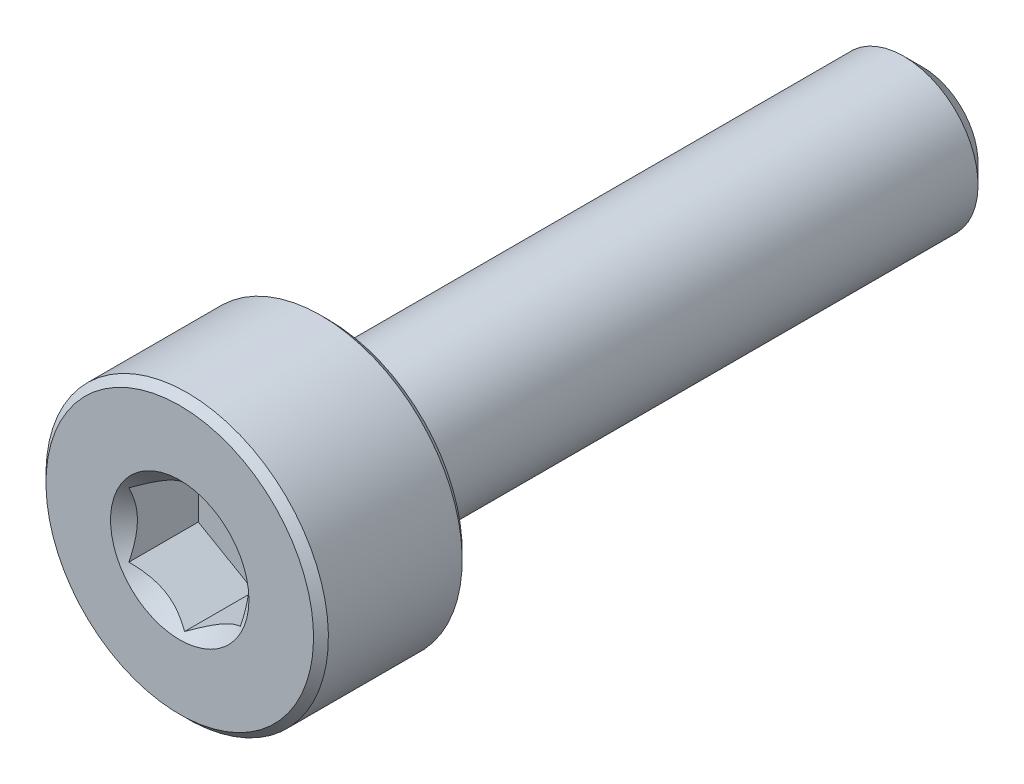
ISO-10303-21;
HEADER;
FILE_DESCRIPTION(('STEP AP214'),'2;1');
FILE_NAME('part.step','',(''),(''),'','','');
FILE_SCHEMA(('AUTOMOTIVE_DESIGN { 1 0 10303 214 1 1 1 1 }'));
ENDSEC;
DATA;
#1=APPLICATION_CONTEXT('core data for automotive mechanical design processes');
#2=APPLICATION_PROTOCOL_DEFINITION('international standard','automotive_design',2000,#1);
#3=PRODUCT_CONTEXT('',#1,'mechanical');
#4=PRODUCT('Part','Part','',(#3));
#5=PRODUCT_RELATED_PRODUCT_CATEGORY('part','',(#4));
#6=PRODUCT_DEFINITION_FORMATION('','',#4);
#7=PRODUCT_DEFINITION_CONTEXT('part definition',#1,'design');
#8=PRODUCT_DEFINITION('design','',#6,#7);
#9=PRODUCT_DEFINITION_SHAPE('','',#8);
#10=(LENGTH_UNIT() NAMED_UNIT(*) SI_UNIT(.MILLI.,.METRE.));
#11=(NAMED_UNIT(*) PLANE_ANGLE_UNIT() SI_UNIT($,.RADIAN.));
#12=(NAMED_UNIT(*) SI_UNIT($,.STERADIAN.) SOLID_ANGLE_UNIT());
#13=UNCERTAINTY_MEASURE_WITH_UNIT(LENGTH_MEASURE(1.E-05),#10,'distance_accuracy_value','');
#14=(GEOMETRIC_REPRESENTATION_CONTEXT(3) GLOBAL_UNCERTAINTY_ASSIGNED_CONTEXT((#13)) GLOBAL_UNIT_ASSIGNED_CONTEXT((#10,
#11,#12)) REPRESENTATION_CONTEXT('',''));
#15=CARTESIAN_POINT('',(0.,0.,0.));
#16=DIRECTION('',(0.,0.,1.));
#17=DIRECTION('',(1.,0.,0.));
#18=AXIS2_PLACEMENT_3D('',#15,#16,#17);
#19=CARTESIAN_POINT('',(0.,0.740192378864668,-5.));
#20=DIRECTION('',(0.,0.,-1.));
#21=DIRECTION('',(0.,1.,0.));
#22=AXIS2_PLACEMENT_3D('',#19,#20,#21);
#23=PLANE('',#22);
#24=CARTESIAN_POINT('',(0.,0.,-5.));
#25=DIRECTION('',(0.,0.,-1.));
#26=DIRECTION('',(0.,1.,0.));
#27=AXIS2_PLACEMENT_3D('',#24,#25,#26);
#28=CIRCLE('',#27,0.740192378864668);
#29=CARTESIAN_POINT('',(0.,0.740192378864668,-5.));
#30=VERTEX_POINT('',#29);
#31=EDGE_CURVE('E57',#30,#30,#28,.T.);
#32=ORIENTED_EDGE('',*,*,#31,.T.);
#33=EDGE_LOOP('',(#32));
#34=FACE_BOUND('',#33,.T.);
#35=ADVANCED_FACE('F43',(#34),#23,.T.);
#36=CARTESIAN_POINT('',(0.,0.,-5.));
#37=DIRECTION('',(0.,0.,1.));
#38=DIRECTION('',(0.,-1.,0.));
#39=AXIS2_PLACEMENT_3D('',#36,#37,#38);
#40=CONICAL_SURFACE('',#39,0.740192378864668,0.785398163397447);
#41=CARTESIAN_POINT('',(0.,0.,-4.74019237886467));
#42=DIRECTION('',(0.,0.,-1.));
#43=DIRECTION('',(0.,1.,0.));
#44=AXIS2_PLACEMENT_3D('',#41,#42,#43);
#45=CIRCLE('',#44,1.);
#46=CARTESIAN_POINT('',(0.,1.,-4.74019237886467));
#47=VERTEX_POINT('',#46);
#48=EDGE_CURVE('E175',#47,#47,#45,.T.);
#49=ORIENTED_EDGE('',*,*,#48,.T.);
#50=EDGE_LOOP('',(#49));
#51=FACE_BOUND('',#50,.T.);
#52=ORIENTED_EDGE('',*,*,#31,.F.);
#53=EDGE_LOOP('',(#52));
#54=FACE_BOUND('',#53,.T.);
#55=ADVANCED_FACE('F183',(#51,#54),#40,.T.);
#56=CARTESIAN_POINT('',(0.,0.,-5.));
#57=DIRECTION('',(0.,0.,-1.));
#58=DIRECTION('',(0.,1.,0.));
#59=AXIS2_PLACEMENT_3D('',#56,#57,#58);
#60=CYLINDRICAL_SURFACE('',#59,1.);
#61=CARTESIAN_POINT('',(0.,0.,2.9));
#62=DIRECTION('',(0.,0.,-1.));
#63=DIRECTION('',(0.,1.,0.));
#64=AXIS2_PLACEMENT_3D('',#61,#62,#63);
#65=CIRCLE('',#64,1.);
#66=CARTESIAN_POINT('',(0.,1.,2.9));
#67=VERTEX_POINT('',#66);
#68=EDGE_CURVE('E171',#67,#67,#65,.T.);
#69=ORIENTED_EDGE('',*,*,#68,.T.);
#70=EDGE_LOOP('',(#69));
#71=FACE_BOUND('',#70,.T.);
#72=ORIENTED_EDGE('',*,*,#48,.F.);
#73=EDGE_LOOP('',(#72));
#74=FACE_BOUND('',#73,.T.);
#75=ADVANCED_FACE('F185',(#71,#74),#60,.T.);
#76=CARTESIAN_POINT('',(0.,0.,2.9));
#77=DIRECTION('',(0.,0.,-1.));
#78=DIRECTION('',(0.,1.,0.));
#79=AXIS2_PLACEMENT_3D('',#76,#77,#78);
#80=TOROIDAL_SURFACE('',#79,1.1,0.0999999999999992);
#81=CARTESIAN_POINT('',(0.,0.,3.));
#82=DIRECTION('',(0.,0.,-1.));
#83=DIRECTION('',(0.,1.,0.));
#84=AXIS2_PLACEMENT_3D('',#81,#82,#83);
#85=CIRCLE('',#84,1.1);
#86=CARTESIAN_POINT('',(0.,1.1,3.));
#87=VERTEX_POINT('',#86);
#88=EDGE_CURVE('E167',#87,#87,#85,.T.);
#89=ORIENTED_EDGE('',*,*,#88,.T.);
#90=EDGE_LOOP('',(#89));
#91=FACE_BOUND('',#90,.T.);
#92=ORIENTED_EDGE('',*,*,#68,.F.);
#93=EDGE_LOOP('',(#92));
#94=FACE_BOUND('',#93,.T.);
#95=ADVANCED_FACE('F191',(#91,#94),#80,.F.);
#96=CARTESIAN_POINT('',(0.,1.8,3.));
#97=DIRECTION('',(0.,0.,-1.));
#98=DIRECTION('',(0.,1.,0.));
#99=AXIS2_PLACEMENT_3D('',#96,#97,#98);
#100=PLANE('',#99);
#101=CARTESIAN_POINT('',(0.,0.,3.));
#102=DIRECTION('',(0.,0.,-1.));
#103=DIRECTION('',(0.,1.,0.));
#104=AXIS2_PLACEMENT_3D('',#101,#102,#103);
#105=CIRCLE('',#104,1.8);
#106=CARTESIAN_POINT('',(0.,1.8,3.));
#107=VERTEX_POINT('',#106);
#108=EDGE_CURVE('E163',#107,#107,#105,.T.);
#109=ORIENTED_EDGE('',*,*,#108,.T.);
#110=EDGE_LOOP('',(#109));
#111=FACE_BOUND('',#110,.T.);
#112=ORIENTED_EDGE('',*,*,#88,.F.);
#113=EDGE_LOOP('',(#112));
#114=FACE_BOUND('',#113,.T.);
#115=ADVANCED_FACE('F197',(#111,#114),#100,.T.);
#116=CARTESIAN_POINT('',(0.,0.,3.));
#117=DIRECTION('',(0.,0.,1.));
#118=DIRECTION('',(0.,-1.,0.));
#119=AXIS2_PLACEMENT_3D('',#116,#117,#118);
#120=CONICAL_SURFACE('',#119,1.8,0.785398163397452);
#121=CARTESIAN_POINT('',(0.,0.,3.1));
#122=DIRECTION('',(0.,0.,-1.));
#123=DIRECTION('',(0.,1.,0.));
#124=AXIS2_PLACEMENT_3D('',#121,#122,#123);
#125=CIRCLE('',#124,1.9);
#126=CARTESIAN_POINT('',(0.,1.9,3.1));
#127=VERTEX_POINT('',#126);
#128=EDGE_CURVE('E159',#127,#127,#125,.T.);
#129=ORIENTED_EDGE('',*,*,#128,.T.);
#130=EDGE_LOOP('',(#129));
#131=FACE_BOUND('',#130,.T.);
#132=ORIENTED_EDGE('',*,*,#108,.F.);
#133=EDGE_LOOP('',(#132));
#134=FACE_BOUND('',#133,.T.);
#135=ADVANCED_FACE('F201',(#131,#134),#120,.T.);
#136=CARTESIAN_POINT('',(0.,0.,-5.));
#137=DIRECTION('',(0.,0.,-1.));
#138=DIRECTION('',(0.,1.,0.));
#139=AXIS2_PLACEMENT_3D('',#136,#137,#138);
#140=CYLINDRICAL_SURFACE('',#139,1.9);
#141=CARTESIAN_POINT('',(0.,0.,4.9));
#142=DIRECTION('',(0.,0.,-1.));
#143=DIRECTION('',(0.,1.,0.));
#144=AXIS2_PLACEMENT_3D('',#141,#142,#143);
#145=CIRCLE('',#144,1.9);
#146=CARTESIAN_POINT('',(0.,1.9,4.9));
#147=VERTEX_POINT('',#146);
#148=EDGE_CURVE('E155',#147,#147,#145,.T.);
#149=ORIENTED_EDGE('',*,*,#148,.T.);
#150=EDGE_LOOP('',(#149));
#151=FACE_BOUND('',#150,.T.);
#152=ORIENTED_EDGE('',*,*,#128,.F.);
#153=EDGE_LOOP('',(#152));
#154=FACE_BOUND('',#153,.T.);
#155=ADVANCED_FACE('F205',(#151,#154),#140,.T.);
#156=CARTESIAN_POINT('',(0.,0.,4.9));
#157=DIRECTION('',(0.,0.,-1.));
#158=DIRECTION('',(0.,1.,0.));
#159=AXIS2_PLACEMENT_3D('',#156,#157,#158);
#160=CONICAL_SURFACE('',#159,1.9,0.785398163397452);
#161=CARTESIAN_POINT('',(0.,0.,5.));
#162=DIRECTION('',(0.,0.,-1.));
#163=DIRECTION('',(0.,1.,0.));
#164=AXIS2_PLACEMENT_3D('',#161,#162,#163);
#165=CIRCLE('',#164,1.8);
#166=CARTESIAN_POINT('',(0.,1.8,5.));
#167=VERTEX_POINT('',#166);
#168=EDGE_CURVE('E151',#167,#167,#165,.T.);
#169=ORIENTED_EDGE('',*,*,#168,.T.);
#170=EDGE_LOOP('',(#169));
#171=FACE_BOUND('',#170,.T.);
#172=ORIENTED_EDGE('',*,*,#148,.F.);
#173=EDGE_LOOP('',(#172));
#174=FACE_BOUND('',#173,.T.);
#175=ADVANCED_FACE('F209',(#171,#174),#160,.T.);
#176=CARTESIAN_POINT('',(0.,0.,5.));
#177=DIRECTION('',(0.,0.,1.));
#178=DIRECTION('',(0.,-1.,0.));
#179=AXIS2_PLACEMENT_3D('',#176,#177,#178);
#180=PLANE('',#179);
#181=CARTESIAN_POINT('',(0.,0.,5.));
#182=DIRECTION('',(0.,0.,1.));
#183=DIRECTION('',(1.,0.,0.));
#184=AXIS2_PLACEMENT_3D('',#181,#182,#183);
#185=CIRCLE('',#184,0.930977309068267);
#186=CARTESIAN_POINT('',(0.930977309068267,0.,5.));
#187=VERTEX_POINT('',#186);
#188=EDGE_CURVE('E117',#187,#187,#185,.T.);
#189=ORIENTED_EDGE('',*,*,#188,.F.);
#190=EDGE_LOOP('',(#189));
#191=FACE_BOUND('',#190,.T.);
#192=ORIENTED_EDGE('',*,*,#168,.F.);
#193=EDGE_LOOP('',(#192));
#194=FACE_BOUND('',#193,.T.);
#195=ADVANCED_FACE('F213',(#191,#194),#180,.T.);
#196=CARTESIAN_POINT('',(0.,0.,5.));
#197=DIRECTION('',(0.,0.,1.));
#198=DIRECTION('',(1.,0.,0.));
#199=AXIS2_PLACEMENT_3D('',#196,#197,#198);
#200=CONICAL_SURFACE('',#199,0.930977309068267,0.78539816339745);
#201=ORIENTED_EDGE('',*,*,#188,.T.);
#202=EDGE_LOOP('',(#201));
#203=FACE_BOUND('',#202,.T.);
#204=CARTESIAN_POINT('',(-0.000200000000000882,-0.86614087383827,4.93516358786093));
#205=CARTESIAN_POINT('',(0.0255899625576805,-0.851251032013203,4.92028220518009));
#206=CARTESIAN_POINT('',(0.0518112021286581,-0.836112192288413,4.90627436032312));
#207=CARTESIAN_POINT('',(0.105279708235705,-0.805242135894342,4.88062561939842));
#208=CARTESIAN_POINT('',(0.132532067460571,-0.789507978959813,4.86899900642183));
#209=CARTESIAN_POINT('',(0.187485350381351,-0.757780686272647,4.84908214048841));
#210=CARTESIAN_POINT('',(0.215172256695507,-0.741795643459142,4.84074178879754));
#211=CARTESIAN_POINT('',(0.271155595130851,-0.709473647943362,4.82789083667759));
#212=CARTESIAN_POINT('',(0.299450314843643,-0.693137683900537,4.823370635305));
#213=CARTESIAN_POINT('',(0.348210289268841,-0.664986099540469,4.8192939278136));
#214=CARTESIAN_POINT('',(0.36861206565557,-0.653207128451645,4.81869089133025));
#215=CARTESIAN_POINT('',(0.409376134696357,-0.629671982217682,4.81970260073169));
#216=CARTESIAN_POINT('',(0.429738417651452,-0.617915812672242,4.8213178357062));
#217=CARTESIAN_POINT('',(0.49053454308682,-0.582815153286446,4.8293842416892));
#218=CARTESIAN_POINT('',(0.530665854996095,-0.559645329552694,4.83905703054389));
#219=CARTESIAN_POINT('',(0.601110400354022,-0.518974152327354,4.86240441268848));
#220=CARTESIAN_POINT('',(0.631753572009084,-0.50128230892348,4.87485665278842));
#221=CARTESIAN_POINT('',(0.691839345804789,-0.466591771248063,4.90290770494703));
#222=CARTESIAN_POINT('',(0.72128548838159,-0.44959103290475,4.91849628061992));
#223=CARTESIAN_POINT('',(0.7502,-0.432897231838375,4.93516358786094));
#224=B_SPLINE_CURVE_WITH_KNOTS('',3,(#204,#205,#206,#207,#208,#209,#210,#211,#212,#213,#214,
#215,#216,#217,#218,#219,#220,#221,#222,#223),.UNSPECIFIED.,.F.,.F.,(4,2,2,2,2,2,2,2,2,4),(0.,
0.0999419466095593,0.200466857654445,0.299393763705716,0.398071297300228,0.468665775681745,
0.539275821398836,0.680536257244562,0.792918418368073,0.904939568716033),.UNSPECIFIED.);
#225=CARTESIAN_POINT('',(0.,-0.866025403784432,4.93504809471617));
#226=VERTEX_POINT('',#225);
#227=CARTESIAN_POINT('',(0.75,-0.433012701892213,4.93504809471617));
#228=VERTEX_POINT('',#227);
#229=EDGE_CURVE('E12',#226,#228,#224,.T.);
#230=ORIENTED_EDGE('',*,*,#229,.F.);
#231=CARTESIAN_POINT('',(-0.750199999999995,-0.43289723183838,4.93516358786094));
#232=CARTESIAN_POINT('',(-0.724410037442314,-0.447787073663448,4.92028220518009));
#233=CARTESIAN_POINT('',(-0.698188797871336,-0.462925913388237,4.90627436032312));
#234=CARTESIAN_POINT('',(-0.644720291764289,-0.493795969782308,4.88062561939843));
#235=CARTESIAN_POINT('',(-0.617467932539423,-0.509530126716837,4.86899900642183));
#236=CARTESIAN_POINT('',(-0.562514649618643,-0.541257419404003,4.84908214048841));
#237=CARTESIAN_POINT('',(-0.534827743304487,-0.557242462217509,4.84074178879754));
#238=CARTESIAN_POINT('',(-0.478844404869143,-0.589564457733288,4.82789083667759));
#239=CARTESIAN_POINT('',(-0.450549685156351,-0.605900421776113,4.823370635305));
#240=CARTESIAN_POINT('',(-0.401789710731153,-0.634052006136181,4.8192939278136));
#241=CARTESIAN_POINT('',(-0.381387934344424,-0.645830977225005,4.81869089133025));
#242=CARTESIAN_POINT('',(-0.340623865303636,-0.669366123458968,4.81970260073169));
#243=CARTESIAN_POINT('',(-0.320261582348541,-0.681122293004408,4.8213178357062));
#244=CARTESIAN_POINT('',(-0.259465456913173,-0.716222952390204,4.82938424168921));
#245=CARTESIAN_POINT('',(-0.219334145003898,-0.739392776123957,4.83905703054389));
#246=CARTESIAN_POINT('',(-0.148889599645972,-0.780063953349296,4.86240441268848));
#247=CARTESIAN_POINT('',(-0.118246427990912,-0.797755796753168,4.87485665278842));
#248=CARTESIAN_POINT('',(-0.0581606541952101,-0.832446334428584,4.90290770494703));
#249=CARTESIAN_POINT('',(-0.0287145116184097,-0.849447072771895,4.91849628061992));
#250=CARTESIAN_POINT('',(0.000199999999998813,-0.86614087383827,4.93516358786093));
#251=B_SPLINE_CURVE_WITH_KNOTS('',3,(#231,#232,#233,#234,#235,#236,#237,#238,#239,#240,#241,
#242,#243,#244,#245,#246,#247,#248,#249,#250),.UNSPECIFIED.,.F.,.F.,(4,2,2,2,2,2,2,2,2,4),(0.,
0.0999419466095594,0.200466857654445,0.299393763705716,0.398071297300229,0.468665775681746,
0.539275821398837,0.680536257244564,0.792918418368068,0.904939568716024),.UNSPECIFIED.);
#252=CARTESIAN_POINT('',(-0.749999999999995,-0.433012701892218,4.93504809471617));
#253=VERTEX_POINT('',#252);
#254=EDGE_CURVE('E102',#253,#226,#251,.T.);
#255=ORIENTED_EDGE('',*,*,#254,.F.);
#256=CARTESIAN_POINT('',(-0.749999999999995,-0.908993158424501,5.24748294145465));
#257=CARTESIAN_POINT('',(-0.749999999999995,-0.887052399965032,5.23056165232909));
#258=CARTESIAN_POINT('',(-0.749999999999995,-0.864994452544439,5.21379277142181));
#259=CARTESIAN_POINT('',(-0.749999999999995,-0.820595091161565,5.18062405791495));
#260=CARTESIAN_POINT('',(-0.749999999999995,-0.798253612413865,5.16422431212463));
#261=CARTESIAN_POINT('',(-0.749999999999995,-0.730403515944951,5.1154409498094));
#262=CARTESIAN_POINT('',(-0.749999999999995,-0.684401486090211,5.08373263056153));
#263=CARTESIAN_POINT('',(-0.749999999999995,-0.587630943752086,5.02105127073776));
#264=CARTESIAN_POINT('',(-0.749999999999995,-0.536746006676904,4.99025604006539));
#265=CARTESIAN_POINT('',(-0.749999999999995,-0.432383376454021,4.93362577183307));
#266=CARTESIAN_POINT('',(-0.749999999999995,-0.378915238071278,4.90777398153742));
#267=CARTESIAN_POINT('',(-0.749999999999996,-0.299071429351745,4.876137143555));
#268=CARTESIAN_POINT('',(-0.749999999999996,-0.273980510808172,4.86713858920674));
#269=CARTESIAN_POINT('',(-0.749999999999996,-0.223167896807674,4.85114618527223));
#270=CARTESIAN_POINT('',(-0.749999999999996,-0.197446161667869,4.8441524621572));
#271=CARTESIAN_POINT('',(-0.749999999999996,-0.120459338268895,4.82702750339353));
#272=CARTESIAN_POINT('',(-0.749999999999996,-0.0683464355179093,4.82031613453524));
#273=CARTESIAN_POINT('',(-0.749999999999996,0.0337920589257216,4.81812532119166));
#274=CARTESIAN_POINT('',(-0.749999999999996,0.0838066628456616,4.82215654120047));
#275=CARTESIAN_POINT('',(-0.749999999999996,0.157981834018415,4.83507488581104));
#276=CARTESIAN_POINT('',(-0.749999999999996,0.182796003556084,4.84061230050464));
#277=CARTESIAN_POINT('',(-0.749999999999996,0.231887166565739,4.853698524901));
#278=CARTESIAN_POINT('',(-0.749999999999996,0.256164188491815,4.86124722778305));
#279=CARTESIAN_POINT('',(-0.749999999999996,0.330659225549256,4.88730560295686));
#280=CARTESIAN_POINT('',(-0.749999999999996,0.379861121085843,4.90870212699338));
#281=CARTESIAN_POINT('',(-0.749999999999996,0.475970605705222,4.95631977440889));
#282=CARTESIAN_POINT('',(-0.749999999999996,0.522869373813369,4.98255785460995));
#283=CARTESIAN_POINT('',(-0.749999999999996,0.612520945812658,5.03673908179183));
#284=CARTESIAN_POINT('',(-0.749999999999996,0.655364174071619,5.06453453547661));
#285=CARTESIAN_POINT('',(-0.749999999999997,0.718484766813282,5.10752522590747));
#286=CARTESIAN_POINT('',(-0.749999999999997,0.739253587078312,5.12201132387884));
#287=CARTESIAN_POINT('',(-0.749999999999997,0.780506229689751,5.15137241519742));
#288=CARTESIAN_POINT('',(-0.749999999999997,0.800990128619762,5.16624730082227));
#289=CARTESIAN_POINT('',(-0.749999999999997,0.821355148585425,5.18128357764302));
#290=B_SPLINE_CURVE_WITH_KNOTS('',3,(#256,#257,#258,#259,#260,#261,#262,#263,#264,#265,#266,
#267,#268,#269,#270,#271,#272,#273,#274,#275,#276,#277,#278,#279,#280,#281,#282,#283,#284,#285,
#286,#287,#288,#289),.UNSPECIFIED.,.F.,.F.,(4,2,2,2,2,2,2,2,2,2,2,2,2,2,2,2,4),(0.,
0.0831217081502307,0.166262763947899,0.333808791437732,0.512108301465775,0.689792429955631,
0.769685928013999,0.849584464902762,1.00608040173681,1.15557098404965,1.23177009418091,
1.30796515813853,1.46846030983728,1.62952862501053,1.78266144768383,1.85862369010575,
1.93456510404422),.UNSPECIFIED.);
#291=CARTESIAN_POINT('',(-0.749999999999996,0.433012701892217,4.93504809471617));
#292=VERTEX_POINT('',#291);
#293=EDGE_CURVE('E116',#292,#253,#290,.F.);
#294=ORIENTED_EDGE('',*,*,#293,.F.);
#295=CARTESIAN_POINT('',(0.000199999999999783,0.866140873838272,4.93516358786094));
#296=CARTESIAN_POINT('',(-0.0255899625576815,0.851251032013204,4.92028220518009));
#297=CARTESIAN_POINT('',(-0.0518112021286592,0.836112192288415,4.90627436032312));
#298=CARTESIAN_POINT('',(-0.105279708235706,0.805242135894344,4.88062561939843));
#299=CARTESIAN_POINT('',(-0.132532067460572,0.789507978959815,4.86899900642183));
#300=CARTESIAN_POINT('',(-0.187485350381352,0.757780686272649,4.84908214048841));
#301=CARTESIAN_POINT('',(-0.215172256695509,0.741795643459143,4.84074178879754));
#302=CARTESIAN_POINT('',(-0.271155595130852,0.709473647943364,4.82789083667759));
#303=CARTESIAN_POINT('',(-0.299450314843644,0.693137683900538,4.823370635305));
#304=CARTESIAN_POINT('',(-0.348210289268842,0.664986099540471,4.8192939278136));
#305=CARTESIAN_POINT('',(-0.368612065655571,0.653207128451646,4.81869089133025));
#306=CARTESIAN_POINT('',(-0.409376134696358,0.629671982217683,4.81970260073169));
#307=CARTESIAN_POINT('',(-0.429738417651453,0.617915812672244,4.8213178357062));
#308=CARTESIAN_POINT('',(-0.490534543086821,0.582815153286448,4.82938424168921));
#309=CARTESIAN_POINT('',(-0.530665854996097,0.559645329552695,4.83905703054389));
#310=CARTESIAN_POINT('',(-0.601110400354023,0.518974152327355,4.86240441268848));
#311=CARTESIAN_POINT('',(-0.631753572009083,0.501282308923482,4.87485665278842));
#312=CARTESIAN_POINT('',(-0.691839345804786,0.466591771248066,4.90290770494703));
#313=CARTESIAN_POINT('',(-0.721285488381587,0.449591032904754,4.91849628061992));
#314=CARTESIAN_POINT('',(-0.750199999999996,0.432897231838379,4.93516358786094));
#315=B_SPLINE_CURVE_WITH_KNOTS('',3,(#295,#296,#297,#298,#299,#300,#301,#302,#303,#304,#305,
#306,#307,#308,#309,#310,#311,#312,#313,#314),.UNSPECIFIED.,.F.,.F.,(4,2,2,2,2,2,2,2,2,4),(0.,
0.0999419466095594,0.200466857654445,0.299393763705716,0.398071297300228,0.468665775681745,
0.539275821398836,0.680536257244563,0.79291841836807,0.904939568716027),.UNSPECIFIED.);
#316=CARTESIAN_POINT('',(0.,0.866025403784434,4.93504809471617));
#317=VERTEX_POINT('',#316);
#318=EDGE_CURVE('E264',#317,#292,#315,.T.);
#319=ORIENTED_EDGE('',*,*,#318,.F.);
#320=CARTESIAN_POINT('',(0.7502,0.432897231838378,4.93516358786094));
#321=CARTESIAN_POINT('',(0.724410037442318,0.447787073663446,4.92028220518009));
#322=CARTESIAN_POINT('',(0.69818879787134,0.462925913388236,4.90627436032313));
#323=CARTESIAN_POINT('',(0.644720291764292,0.493795969782307,4.88062561939843));
#324=CARTESIAN_POINT('',(0.617467932539426,0.509530126716836,4.86899900642184));
#325=CARTESIAN_POINT('',(0.562514649618645,0.541257419404002,4.84908214048841));
#326=CARTESIAN_POINT('',(0.534827743304489,0.557242462217508,4.84074178879754));
#327=CARTESIAN_POINT('',(0.478844404869145,0.589564457733288,4.82789083667759));
#328=CARTESIAN_POINT('',(0.450549685156352,0.605900421776114,4.82337063530501));
#329=CARTESIAN_POINT('',(0.401789710731154,0.634052006136181,4.8192939278136));
#330=CARTESIAN_POINT('',(0.381387934344425,0.645830977225006,4.81869089133025));
#331=CARTESIAN_POINT('',(0.340623865303637,0.669366123458969,4.81970260073169));
#332=CARTESIAN_POINT('',(0.320261582348542,0.681122293004408,4.8213178357062));
#333=CARTESIAN_POINT('',(0.259465456913174,0.716222952390205,4.82938424168921));
#334=CARTESIAN_POINT('',(0.219334145003898,0.739392776123957,4.83905703054389));
#335=CARTESIAN_POINT('',(0.148889599645972,0.780063953349297,4.86240441268848));
#336=CARTESIAN_POINT('',(0.118246427990912,0.797755796753169,4.87485665278842));
#337=CARTESIAN_POINT('',(0.0581606541952097,0.832446334428585,4.90290770494703));
#338=CARTESIAN_POINT('',(0.028714511618409,0.849447072771897,4.91849628061992));
#339=CARTESIAN_POINT('',(-0.000200000000000035,0.866140873838272,4.93516358786094));
#340=B_SPLINE_CURVE_WITH_KNOTS('',3,(#320,#321,#322,#323,#324,#325,#326,#327,#328,#329,#330,
#331,#332,#333,#334,#335,#336,#337,#338,#339),.UNSPECIFIED.,.F.,.F.,(4,2,2,2,2,2,2,2,2,4),(0.,
0.0999419466095603,0.200466857654448,0.299393763705719,0.398071297300233,0.468665775681751,
0.539275821398842,0.680536257244569,0.792918418368074,0.904939568716031),.UNSPECIFIED.);
#341=CARTESIAN_POINT('',(0.75,0.433012701892216,4.93504809471617));
#342=VERTEX_POINT('',#341);
#343=EDGE_CURVE('E237',#342,#317,#340,.T.);
#344=ORIENTED_EDGE('',*,*,#343,.F.);
#345=CARTESIAN_POINT('',(0.75,-0.90899315842449,5.24748294145465));
#346=CARTESIAN_POINT('',(0.75,-0.887052399965022,5.23056165232909));
#347=CARTESIAN_POINT('',(0.75,-0.864994452544429,5.21379277142181));
#348=CARTESIAN_POINT('',(0.75,-0.820595091161555,5.18062405791495));
#349=CARTESIAN_POINT('',(0.75,-0.798253612413856,5.16422431212463));
#350=CARTESIAN_POINT('',(0.75,-0.730403515944942,5.1154409498094));
#351=CARTESIAN_POINT('',(0.75,-0.684401486090202,5.08373263056153));
#352=CARTESIAN_POINT('',(0.75,-0.587630943752078,5.02105127073776));
#353=CARTESIAN_POINT('',(0.75,-0.536746006676896,4.99025604006539));
#354=CARTESIAN_POINT('',(0.75,-0.432383376454015,4.93362577183307));
#355=CARTESIAN_POINT('',(0.75,-0.378915238071272,4.90777398153742));
#356=CARTESIAN_POINT('',(0.75,-0.299071429351739,4.876137143555));
#357=CARTESIAN_POINT('',(0.75,-0.273980510808166,4.86713858920674));
#358=CARTESIAN_POINT('',(0.75,-0.223167896807669,4.85114618527224));
#359=CARTESIAN_POINT('',(0.75,-0.197446161667865,4.84415246215721));
#360=CARTESIAN_POINT('',(0.75,-0.120459338268891,4.82702750339353));
#361=CARTESIAN_POINT('',(0.75,-0.0683464355179053,4.82031613453524));
#362=CARTESIAN_POINT('',(0.75,0.0337920589257253,4.81812532119166));
#363=CARTESIAN_POINT('',(0.75,0.0838066628456652,4.82215654120047));
#364=CARTESIAN_POINT('',(0.75,0.157981834018418,4.83507488581104));
#365=CARTESIAN_POINT('',(0.75,0.182796003556087,4.84061230050464));
#366=CARTESIAN_POINT('',(0.75,0.231887166565743,4.85369852490101));
#367=CARTESIAN_POINT('',(0.75,0.256164188491818,4.86124722778306));
#368=CARTESIAN_POINT('',(0.75,0.330659225549259,4.88730560295687));
#369=CARTESIAN_POINT('',(0.75,0.379861121085847,4.90870212699338));
#370=CARTESIAN_POINT('',(0.75,0.475970605705226,4.95631977440889));
#371=CARTESIAN_POINT('',(0.75,0.522869373813374,4.98255785460996));
#372=CARTESIAN_POINT('',(0.75,0.612520945812664,5.03673908179184));
#373=CARTESIAN_POINT('',(0.75,0.655364174071626,5.06453453547662));
#374=CARTESIAN_POINT('',(0.75,0.718484766813289,5.10752522590747));
#375=CARTESIAN_POINT('',(0.75,0.739253587078319,5.12201132387884));
#376=CARTESIAN_POINT('',(0.75,0.780506229689757,5.15137241519742));
#377=CARTESIAN_POINT('',(0.75,0.800990128619769,5.16624730082228));
#378=CARTESIAN_POINT('',(0.75,0.821355148585432,5.18128357764303));
#379=B_SPLINE_CURVE_WITH_KNOTS('',3,(#345,#346,#347,#348,#349,#350,#351,#352,#353,#354,#355,
#356,#357,#358,#359,#360,#361,#362,#363,#364,#365,#366,#367,#368,#369,#370,#371,#372,#373,#374,
#375,#376,#377,#378),.UNSPECIFIED.,.F.,.F.,(4,2,2,2,2,2,2,2,2,2,2,2,2,2,2,2,4),(0.,
0.0831217081502297,0.166262763947897,0.333808791437728,0.512108301465769,0.689792429955623,
0.76968592801399,0.849584464902752,1.0060804017368,1.15557098404964,1.2317700941809,
1.30796515813852,1.46846030983727,1.62952862501053,1.78266144768382,1.85862369010574,
1.93456510404421),.UNSPECIFIED.);
#380=EDGE_CURVE('E64',#228,#342,#379,.T.);
#381=ORIENTED_EDGE('',*,*,#380,.F.);
#382=EDGE_LOOP('',(#230,#255,#294,#319,#344,#381));
#383=FACE_BOUND('',#382,.T.);
#384=ADVANCED_FACE('F101',(#203,#383),#200,.F.);
#385=CARTESIAN_POINT('',(0.,1.8,4.));
#386=DIRECTION('',(0.,0.,-1.));
#387=DIRECTION('',(0.,1.,0.));
#388=AXIS2_PLACEMENT_3D('',#385,#386,#387);
#389=PLANE('',#388);
#390=DIRECTION('',(0.866025403784439,0.5,0.));
#391=VECTOR('',#390,1.);
#392=CARTESIAN_POINT('',(0.,-0.866025403784432,4.));
#393=LINE('',#392,#391);
#394=CARTESIAN_POINT('',(0.,-0.866025403784432,4.));
#395=VERTEX_POINT('',#394);
#396=CARTESIAN_POINT('',(0.75,-0.433012701892213,4.));
#397=VERTEX_POINT('',#396);
#398=EDGE_CURVE('E120',#395,#397,#393,.T.);
#399=ORIENTED_EDGE('',*,*,#398,.T.);
#400=DIRECTION('',(0.,1.,0.));
#401=VECTOR('',#400,1.);
#402=CARTESIAN_POINT('',(0.75,-0.433012701892213,4.));
#403=LINE('',#402,#401);
#404=CARTESIAN_POINT('',(0.75,0.433012701892216,4.));
#405=VERTEX_POINT('',#404);
#406=EDGE_CURVE('E71',#397,#405,#403,.T.);
#407=ORIENTED_EDGE('',*,*,#406,.T.);
#408=DIRECTION('',(-0.866025403784439,0.499999999999999,0.));
#409=VECTOR('',#408,1.);
#410=CARTESIAN_POINT('',(0.75,0.433012701892216,4.));
#411=LINE('',#410,#409);
#412=CARTESIAN_POINT('',(0.,0.866025403784434,4.));
#413=VERTEX_POINT('',#412);
#414=EDGE_CURVE('E131',#405,#413,#411,.T.);
#415=ORIENTED_EDGE('',*,*,#414,.T.);
#416=DIRECTION('',(-0.866025403784438,-0.5,0.));
#417=VECTOR('',#416,1.);
#418=CARTESIAN_POINT('',(0.,0.866025403784434,4.));
#419=LINE('',#418,#417);
#420=CARTESIAN_POINT('',(-0.749999999999996,0.433012701892217,4.));
#421=VERTEX_POINT('',#420);
#422=EDGE_CURVE('E140',#413,#421,#419,.T.);
#423=ORIENTED_EDGE('',*,*,#422,.T.);
#424=DIRECTION('',(0.,-1.,0.));
#425=VECTOR('',#424,1.);
#426=CARTESIAN_POINT('',(-0.749999999999996,0.433012701892217,4.));
#427=LINE('',#426,#425);
#428=CARTESIAN_POINT('',(-0.749999999999995,-0.433012701892218,4.));
#429=VERTEX_POINT('',#428);
#430=EDGE_CURVE('E135',#421,#429,#427,.T.);
#431=ORIENTED_EDGE('',*,*,#430,.T.);
#432=DIRECTION('',(0.866025403784439,-0.499999999999999,0.));
#433=VECTOR('',#432,1.);
#434=CARTESIAN_POINT('',(-0.749999999999995,-0.433012701892218,4.));
#435=LINE('',#434,#433);
#436=EDGE_CURVE('E122',#429,#395,#435,.T.);
#437=ORIENTED_EDGE('',*,*,#436,.T.);
#438=EDGE_LOOP('',(#399,#407,#415,#423,#431,#437));
#439=FACE_BOUND('',#438,.T.);
#440=ADVANCED_FACE('F218',(#439),#389,.F.);
#441=CARTESIAN_POINT('',(0.,-0.866025403784432,0.70871215252209));
#442=DIRECTION('',(0.5,-0.866025403784439,0.));
#443=DIRECTION('',(0.866025403784439,0.5,0.));
#444=AXIS2_PLACEMENT_3D('',#441,#442,#443);
#445=PLANE('',#444);
#446=DIRECTION('',(0.,0.,1.));
#447=VECTOR('',#446,1.);
#448=CARTESIAN_POINT('',(0.,-0.866025403784432,0.70871215252209));
#449=LINE('',#448,#447);
#450=EDGE_CURVE('E111',#395,#226,#449,.T.);
#451=ORIENTED_EDGE('',*,*,#450,.T.);
#452=ORIENTED_EDGE('',*,*,#229,.T.);
#453=DIRECTION('',(0.,0.,1.));
#454=VECTOR('',#453,1.);
#455=CARTESIAN_POINT('',(0.75,-0.433012701892213,0.70871215252209));
#456=LINE('',#455,#454);
#457=EDGE_CURVE('E126',#397,#228,#456,.T.);
#458=ORIENTED_EDGE('',*,*,#457,.F.);
#459=ORIENTED_EDGE('',*,*,#398,.F.);
#460=EDGE_LOOP('',(#451,#452,#458,#459));
#461=FACE_BOUND('',#460,.T.);
#462=ADVANCED_FACE('F119',(#461),#445,.F.);
#463=CARTESIAN_POINT('',(-0.749999999999995,-0.433012701892218,0.70871215252209));
#464=DIRECTION('',(-0.499999999999999,-0.866025403784439,0.));
#465=DIRECTION('',(0.866025403784439,-0.499999999999999,0.));
#466=AXIS2_PLACEMENT_3D('',#463,#464,#465);
#467=PLANE('',#466);
#468=DIRECTION('',(0.,0.,1.));
#469=VECTOR('',#468,1.);
#470=CARTESIAN_POINT('',(-0.749999999999995,-0.433012701892218,0.70871215252209));
#471=LINE('',#470,#469);
#472=EDGE_CURVE('E114',#429,#253,#471,.T.);
#473=ORIENTED_EDGE('',*,*,#472,.T.);
#474=ORIENTED_EDGE('',*,*,#254,.T.);
#475=ORIENTED_EDGE('',*,*,#450,.F.);
#476=ORIENTED_EDGE('',*,*,#436,.F.);
#477=EDGE_LOOP('',(#473,#474,#475,#476));
#478=FACE_BOUND('',#477,.T.);
#479=ADVANCED_FACE('F110',(#478),#467,.F.);
#480=CARTESIAN_POINT('',(-0.749999999999996,0.433012701892217,0.70871215252209));
#481=DIRECTION('',(-1.,0.,0.));
#482=DIRECTION('',(0.,-1.,0.));
#483=AXIS2_PLACEMENT_3D('',#480,#481,#482);
#484=PLANE('',#483);
#485=DIRECTION('',(0.,0.,1.));
#486=VECTOR('',#485,1.);
#487=CARTESIAN_POINT('',(-0.749999999999996,0.433012701892217,0.70871215252209));
#488=LINE('',#487,#486);
#489=EDGE_CURVE('E136',#421,#292,#488,.T.);
#490=ORIENTED_EDGE('',*,*,#489,.T.);
#491=ORIENTED_EDGE('',*,*,#293,.T.);
#492=ORIENTED_EDGE('',*,*,#472,.F.);
#493=ORIENTED_EDGE('',*,*,#430,.F.);
#494=EDGE_LOOP('',(#490,#491,#492,#493));
#495=FACE_BOUND('',#494,.T.);
#496=ADVANCED_FACE('F274',(#495),#484,.F.);
#497=CARTESIAN_POINT('',(0.,0.866025403784434,0.70871215252209));
#498=DIRECTION('',(-0.5,0.866025403784438,0.));
#499=DIRECTION('',(-0.866025403784438,-0.5,0.));
#500=AXIS2_PLACEMENT_3D('',#497,#498,#499);
#501=PLANE('',#500);
#502=DIRECTION('',(0.,0.,1.));
#503=VECTOR('',#502,1.);
#504=CARTESIAN_POINT('',(0.,0.866025403784434,0.70871215252209));
#505=LINE('',#504,#503);
#506=EDGE_CURVE('E141',#413,#317,#505,.T.);
#507=ORIENTED_EDGE('',*,*,#506,.T.);
#508=ORIENTED_EDGE('',*,*,#318,.T.);
#509=ORIENTED_EDGE('',*,*,#489,.F.);
#510=ORIENTED_EDGE('',*,*,#422,.F.);
#511=EDGE_LOOP('',(#507,#508,#509,#510));
#512=FACE_BOUND('',#511,.T.);
#513=ADVANCED_FACE('F271',(#512),#501,.F.);
#514=CARTESIAN_POINT('',(0.75,0.433012701892216,0.70871215252209));
#515=DIRECTION('',(0.499999999999999,0.866025403784439,0.));
#516=DIRECTION('',(-0.866025403784439,0.499999999999999,0.));
#517=AXIS2_PLACEMENT_3D('',#514,#515,#516);
#518=PLANE('',#517);
#519=DIRECTION('',(0.,0.,1.));
#520=VECTOR('',#519,1.);
#521=CARTESIAN_POINT('',(0.75,0.433012701892216,0.70871215252209));
#522=LINE('',#521,#520);
#523=EDGE_CURVE('E145',#405,#342,#522,.T.);
#524=ORIENTED_EDGE('',*,*,#523,.T.);
#525=ORIENTED_EDGE('',*,*,#343,.T.);
#526=ORIENTED_EDGE('',*,*,#506,.F.);
#527=ORIENTED_EDGE('',*,*,#414,.F.);
#528=EDGE_LOOP('',(#524,#525,#526,#527));
#529=FACE_BOUND('',#528,.T.);
#530=ADVANCED_FACE('F226',(#529),#518,.F.);
#531=CARTESIAN_POINT('',(0.75,-0.433012701892213,0.70871215252209));
#532=DIRECTION('',(1.,0.,0.));
#533=DIRECTION('',(0.,0.,-1.));
#534=AXIS2_PLACEMENT_3D('',#531,#532,#533);
#535=PLANE('',#534);
#536=ORIENTED_EDGE('',*,*,#457,.T.);
#537=ORIENTED_EDGE('',*,*,#380,.T.);
#538=ORIENTED_EDGE('',*,*,#523,.F.);
#539=ORIENTED_EDGE('',*,*,#406,.F.);
#540=EDGE_LOOP('',(#536,#537,#538,#539));
#541=FACE_BOUND('',#540,.T.);
#542=ADVANCED_FACE('F222',(#541),#535,.F.);
#543=CLOSED_SHELL('',(#35,#55,#75,#95,#115,#135,#155,#175,#195,#384,#440,#462,#479,#496,#513,
#530,#542));
#544=MANIFOLD_SOLID_BREP('B2',#543);
#545=ADVANCED_BREP_SHAPE_REPRESENTATION('',(#18,#544),#14);
#546=SHAPE_DEFINITION_REPRESENTATION(#9,#545);
ENDSEC;
END-ISO-10303-21;
